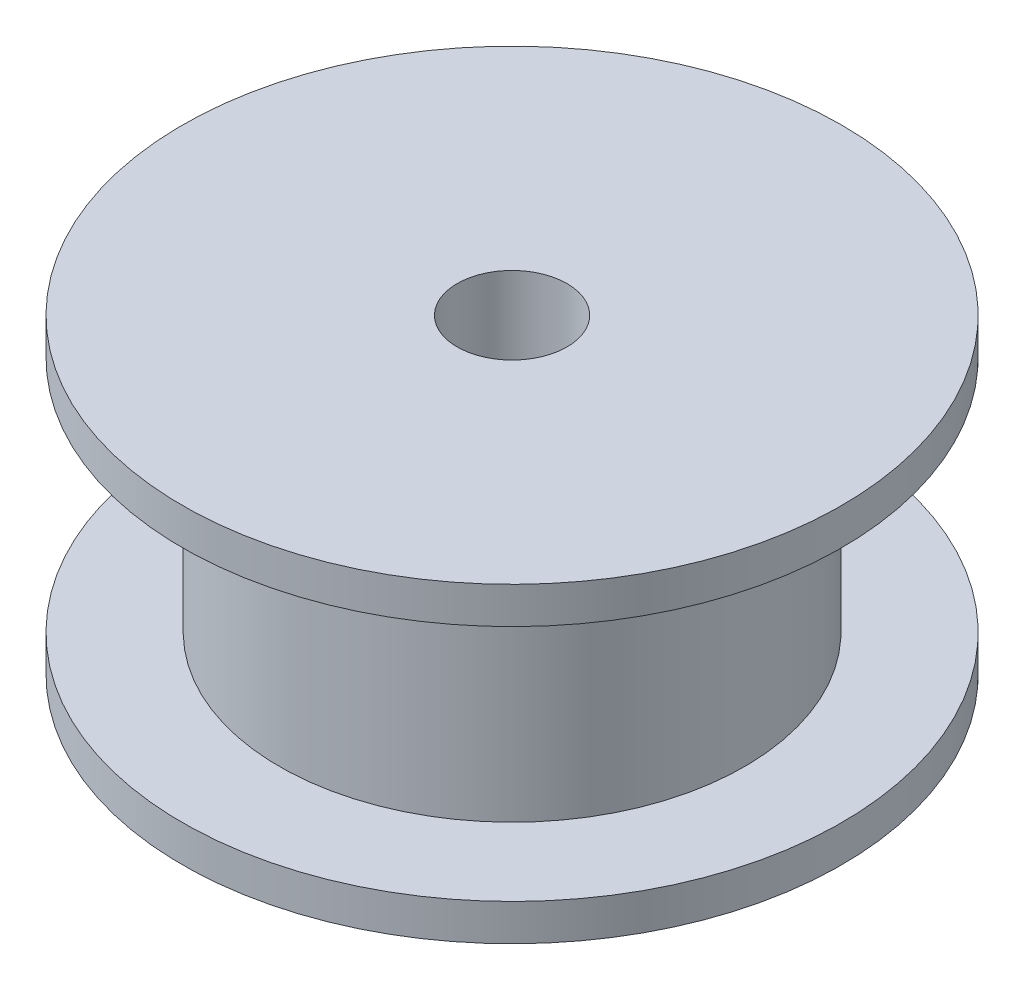
ISO-10303-21;
HEADER;
FILE_DESCRIPTION(('STEP AP214'),'2;1');
FILE_NAME('part.step','',(''),(''),'','','');
FILE_SCHEMA(('AUTOMOTIVE_DESIGN { 1 0 10303 214 1 1 1 1 }'));
ENDSEC;
DATA;
#1=APPLICATION_CONTEXT('core data for automotive mechanical design processes');
#2=APPLICATION_PROTOCOL_DEFINITION('international standard','automotive_design',2000,#1);
#3=PRODUCT_CONTEXT('',#1,'mechanical');
#4=PRODUCT('Part','Part','',(#3));
#5=PRODUCT_RELATED_PRODUCT_CATEGORY('part','',(#4));
#6=PRODUCT_DEFINITION_FORMATION('','',#4);
#7=PRODUCT_DEFINITION_CONTEXT('part definition',#1,'design');
#8=PRODUCT_DEFINITION('design','',#6,#7);
#9=PRODUCT_DEFINITION_SHAPE('','',#8);
#10=(LENGTH_UNIT() NAMED_UNIT(*) SI_UNIT(.MILLI.,.METRE.));
#11=(NAMED_UNIT(*) PLANE_ANGLE_UNIT() SI_UNIT($,.RADIAN.));
#12=(NAMED_UNIT(*) SI_UNIT($,.STERADIAN.) SOLID_ANGLE_UNIT());
#13=UNCERTAINTY_MEASURE_WITH_UNIT(LENGTH_MEASURE(1.E-05),#10,'distance_accuracy_value','');
#14=(GEOMETRIC_REPRESENTATION_CONTEXT(3) GLOBAL_UNCERTAINTY_ASSIGNED_CONTEXT((#13)) GLOBAL_UNIT_ASSIGNED_CONTEXT((#10,
#11,#12)) REPRESENTATION_CONTEXT('',''));
#15=CARTESIAN_POINT('',(0.,0.,0.));
#16=DIRECTION('',(0.,0.,1.));
#17=DIRECTION('',(1.,0.,0.));
#18=AXIS2_PLACEMENT_3D('',#15,#16,#17);
#19=CARTESIAN_POINT('',(0.,0.,0.));
#20=DIRECTION('',(0.,-1.,0.));
#21=DIRECTION('',(0.,0.,-1.));
#22=AXIS2_PLACEMENT_3D('',#19,#20,#21);
#23=CYLINDRICAL_SURFACE('',#22,9.);
#24=CARTESIAN_POINT('',(0.,1.,0.));
#25=DIRECTION('',(0.,-1.,0.));
#26=DIRECTION('',(0.,0.,-1.));
#27=AXIS2_PLACEMENT_3D('',#24,#25,#26);
#28=CIRCLE('',#27,9.);
#29=CARTESIAN_POINT('',(0.,1.,-9.));
#30=VERTEX_POINT('',#29);
#31=EDGE_CURVE('E10',#30,#30,#28,.T.);
#32=ORIENTED_EDGE('',*,*,#31,.T.);
#33=EDGE_LOOP('',(#32));
#34=FACE_BOUND('',#33,.T.);
#35=CARTESIAN_POINT('',(0.,0.,0.));
#36=DIRECTION('',(0.,-1.,0.));
#37=DIRECTION('',(0.,0.,-1.));
#38=AXIS2_PLACEMENT_3D('',#35,#36,#37);
#39=CIRCLE('',#38,9.);
#40=CARTESIAN_POINT('',(0.,0.,-9.));
#41=VERTEX_POINT('',#40);
#42=EDGE_CURVE('E59',#41,#41,#39,.T.);
#43=ORIENTED_EDGE('',*,*,#42,.F.);
#44=EDGE_LOOP('',(#43));
#45=FACE_BOUND('',#44,.T.);
#46=ADVANCED_FACE('F31',(#34,#45),#23,.T.);
#47=CARTESIAN_POINT('',(9.,1.,0.));
#48=DIRECTION('',(0.,1.,0.));
#49=DIRECTION('',(0.,0.,1.));
#50=AXIS2_PLACEMENT_3D('',#47,#48,#49);
#51=PLANE('',#50);
#52=CARTESIAN_POINT('',(0.,1.,0.));
#53=DIRECTION('',(0.,-1.,0.));
#54=DIRECTION('',(0.,0.,-1.));
#55=AXIS2_PLACEMENT_3D('',#52,#53,#54);
#56=CIRCLE('',#55,6.35);
#57=CARTESIAN_POINT('',(0.,1.,-6.35));
#58=VERTEX_POINT('',#57);
#59=EDGE_CURVE('E37',#58,#58,#56,.T.);
#60=ORIENTED_EDGE('',*,*,#59,.T.);
#61=EDGE_LOOP('',(#60));
#62=FACE_BOUND('',#61,.T.);
#63=ORIENTED_EDGE('',*,*,#31,.F.);
#64=EDGE_LOOP('',(#63));
#65=FACE_BOUND('',#64,.T.);
#66=ADVANCED_FACE('F67',(#62,#65),#51,.T.);
#67=CARTESIAN_POINT('',(0.,0.,0.));
#68=DIRECTION('',(0.,-1.,0.));
#69=DIRECTION('',(0.,0.,-1.));
#70=AXIS2_PLACEMENT_3D('',#67,#68,#69);
#71=CYLINDRICAL_SURFACE('',#70,6.35);
#72=CARTESIAN_POINT('',(0.,7.5,0.));
#73=DIRECTION('',(0.,-1.,0.));
#74=DIRECTION('',(0.,0.,-1.));
#75=AXIS2_PLACEMENT_3D('',#72,#73,#74);
#76=CIRCLE('',#75,6.35);
#77=CARTESIAN_POINT('',(0.,7.5,-6.35));
#78=VERTEX_POINT('',#77);
#79=EDGE_CURVE('E41',#78,#78,#76,.T.);
#80=ORIENTED_EDGE('',*,*,#79,.T.);
#81=EDGE_LOOP('',(#80));
#82=FACE_BOUND('',#81,.T.);
#83=ORIENTED_EDGE('',*,*,#59,.F.);
#84=EDGE_LOOP('',(#83));
#85=FACE_BOUND('',#84,.T.);
#86=ADVANCED_FACE('F71',(#82,#85),#71,.T.);
#87=CARTESIAN_POINT('',(6.35,7.5,0.));
#88=DIRECTION('',(0.,-1.,0.));
#89=DIRECTION('',(0.,0.,-1.));
#90=AXIS2_PLACEMENT_3D('',#87,#88,#89);
#91=PLANE('',#90);
#92=CARTESIAN_POINT('',(0.,7.5,0.));
#93=DIRECTION('',(0.,-1.,0.));
#94=DIRECTION('',(0.,0.,-1.));
#95=AXIS2_PLACEMENT_3D('',#92,#93,#94);
#96=CIRCLE('',#95,9.);
#97=CARTESIAN_POINT('',(0.,7.5,-9.));
#98=VERTEX_POINT('',#97);
#99=EDGE_CURVE('E45',#98,#98,#96,.T.);
#100=ORIENTED_EDGE('',*,*,#99,.T.);
#101=EDGE_LOOP('',(#100));
#102=FACE_BOUND('',#101,.T.);
#103=ORIENTED_EDGE('',*,*,#79,.F.);
#104=EDGE_LOOP('',(#103));
#105=FACE_BOUND('',#104,.T.);
#106=ADVANCED_FACE('F75',(#102,#105),#91,.T.);
#107=CARTESIAN_POINT('',(0.,0.,0.));
#108=DIRECTION('',(0.,-1.,0.));
#109=DIRECTION('',(0.,0.,-1.));
#110=AXIS2_PLACEMENT_3D('',#107,#108,#109);
#111=CYLINDRICAL_SURFACE('',#110,9.);
#112=CARTESIAN_POINT('',(0.,8.5,0.));
#113=DIRECTION('',(0.,-1.,0.));
#114=DIRECTION('',(0.,0.,-1.));
#115=AXIS2_PLACEMENT_3D('',#112,#113,#114);
#116=CIRCLE('',#115,9.);
#117=CARTESIAN_POINT('',(0.,8.5,-9.));
#118=VERTEX_POINT('',#117);
#119=EDGE_CURVE('E50',#118,#118,#116,.T.);
#120=ORIENTED_EDGE('',*,*,#119,.T.);
#121=EDGE_LOOP('',(#120));
#122=FACE_BOUND('',#121,.T.);
#123=ORIENTED_EDGE('',*,*,#99,.F.);
#124=EDGE_LOOP('',(#123));
#125=FACE_BOUND('',#124,.T.);
#126=ADVANCED_FACE('F82',(#122,#125),#111,.T.);
#127=CARTESIAN_POINT('',(9.,8.5,0.));
#128=DIRECTION('',(0.,1.,0.));
#129=DIRECTION('',(0.,0.,1.));
#130=AXIS2_PLACEMENT_3D('',#127,#128,#129);
#131=PLANE('',#130);
#132=CARTESIAN_POINT('',(0.,8.5,0.));
#133=DIRECTION('',(0.,-1.,0.));
#134=DIRECTION('',(0.,0.,-1.));
#135=AXIS2_PLACEMENT_3D('',#132,#133,#134);
#136=CIRCLE('',#135,1.5);
#137=CARTESIAN_POINT('',(0.,8.5,-1.5));
#138=VERTEX_POINT('',#137);
#139=EDGE_CURVE('E53',#138,#138,#136,.T.);
#140=ORIENTED_EDGE('',*,*,#139,.T.);
#141=EDGE_LOOP('',(#140));
#142=FACE_BOUND('',#141,.T.);
#143=ORIENTED_EDGE('',*,*,#119,.F.);
#144=EDGE_LOOP('',(#143));
#145=FACE_BOUND('',#144,.T.);
#146=ADVANCED_FACE('F86',(#142,#145),#131,.T.);
#147=CARTESIAN_POINT('',(0.,0.,0.));
#148=DIRECTION('',(0.,-1.,0.));
#149=DIRECTION('',(0.,0.,-1.));
#150=AXIS2_PLACEMENT_3D('',#147,#148,#149);
#151=CYLINDRICAL_SURFACE('',#150,1.5);
#152=CARTESIAN_POINT('',(0.,0.,0.));
#153=DIRECTION('',(0.,-1.,0.));
#154=DIRECTION('',(0.,0.,-1.));
#155=AXIS2_PLACEMENT_3D('',#152,#153,#154);
#156=CIRCLE('',#155,1.5);
#157=CARTESIAN_POINT('',(0.,0.,-1.5));
#158=VERTEX_POINT('',#157);
#159=EDGE_CURVE('E56',#158,#158,#156,.T.);
#160=ORIENTED_EDGE('',*,*,#159,.T.);
#161=EDGE_LOOP('',(#160));
#162=FACE_BOUND('',#161,.T.);
#163=ORIENTED_EDGE('',*,*,#139,.F.);
#164=EDGE_LOOP('',(#163));
#165=FACE_BOUND('',#164,.T.);
#166=ADVANCED_FACE('F90',(#162,#165),#151,.F.);
#167=CARTESIAN_POINT('',(1.5,0.,0.));
#168=DIRECTION('',(0.,-1.,0.));
#169=DIRECTION('',(0.,0.,-1.));
#170=AXIS2_PLACEMENT_3D('',#167,#168,#169);
#171=PLANE('',#170);
#172=ORIENTED_EDGE('',*,*,#42,.T.);
#173=EDGE_LOOP('',(#172));
#174=FACE_BOUND('',#173,.T.);
#175=ORIENTED_EDGE('',*,*,#159,.F.);
#176=EDGE_LOOP('',(#175));
#177=FACE_BOUND('',#176,.T.);
#178=ADVANCED_FACE('F63',(#174,#177),#171,.T.);
#179=CLOSED_SHELL('',(#46,#66,#86,#106,#126,#146,#166,#178));
#180=MANIFOLD_SOLID_BREP('B2',#179);
#181=ADVANCED_BREP_SHAPE_REPRESENTATION('',(#18,#180),#14);
#182=SHAPE_DEFINITION_REPRESENTATION(#9,#181);
ENDSEC;
END-ISO-10303-21;
